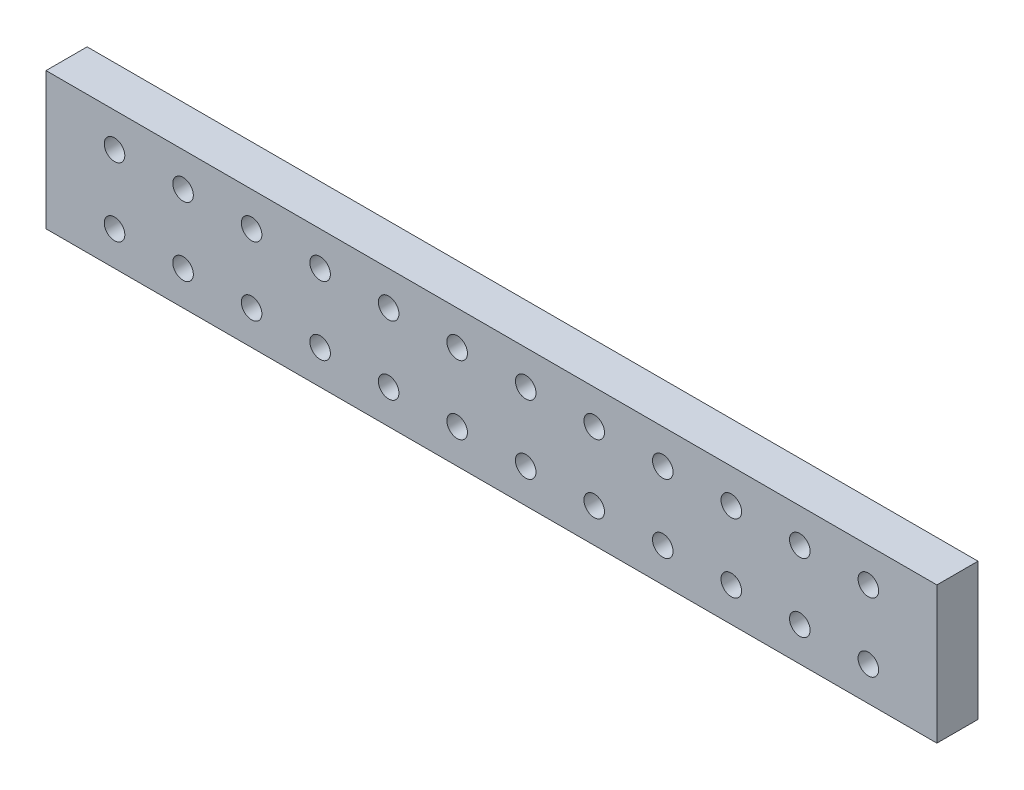
ISO-10303-21;
HEADER;
FILE_DESCRIPTION(('STEP AP214'),'2;1');
FILE_NAME('part.step','',(''),(''),'','','');
FILE_SCHEMA(('AUTOMOTIVE_DESIGN { 1 0 10303 214 1 1 1 1 }'));
ENDSEC;
DATA;
#1=APPLICATION_CONTEXT('core data for automotive mechanical design processes');
#2=APPLICATION_PROTOCOL_DEFINITION('international standard','automotive_design',2000,#1);
#3=PRODUCT_CONTEXT('',#1,'mechanical');
#4=PRODUCT('Part','Part','',(#3));
#5=PRODUCT_RELATED_PRODUCT_CATEGORY('part','',(#4));
#6=PRODUCT_DEFINITION_FORMATION('','',#4);
#7=PRODUCT_DEFINITION_CONTEXT('part definition',#1,'design');
#8=PRODUCT_DEFINITION('design','',#6,#7);
#9=PRODUCT_DEFINITION_SHAPE('','',#8);
#10=(LENGTH_UNIT() NAMED_UNIT(*) SI_UNIT(.MILLI.,.METRE.));
#11=(NAMED_UNIT(*) PLANE_ANGLE_UNIT() SI_UNIT($,.RADIAN.));
#12=(NAMED_UNIT(*) SI_UNIT($,.STERADIAN.) SOLID_ANGLE_UNIT());
#13=UNCERTAINTY_MEASURE_WITH_UNIT(LENGTH_MEASURE(1.E-05),#10,'distance_accuracy_value','');
#14=(GEOMETRIC_REPRESENTATION_CONTEXT(3) GLOBAL_UNCERTAINTY_ASSIGNED_CONTEXT((#13)) GLOBAL_UNIT_ASSIGNED_CONTEXT((#10,
#11,#12)) REPRESENTATION_CONTEXT('',''));
#15=CARTESIAN_POINT('',(0.,0.,0.));
#16=DIRECTION('',(0.,0.,1.));
#17=DIRECTION('',(1.,0.,0.));
#18=AXIS2_PLACEMENT_3D('',#15,#16,#17);
#19=CARTESIAN_POINT('',(0.,0.,6.));
#20=DIRECTION('',(0.,0.,1.));
#21=DIRECTION('',(1.,0.,0.));
#22=AXIS2_PLACEMENT_3D('',#19,#20,#21);
#23=PLANE('',#22);
#24=CARTESIAN_POINT('',(-0.733944954128396,-3.16513761467888,6.));
#25=DIRECTION('',(0.,0.,1.));
#26=DIRECTION('',(1.,0.,0.));
#27=AXIS2_PLACEMENT_3D('',#24,#25,#26);
#28=CIRCLE('',#27,1.5);
#29=CARTESIAN_POINT('',(0.766055045871602,-3.16513761467888,6.));
#30=VERTEX_POINT('',#29);
#31=EDGE_CURVE('E241',#30,#30,#28,.T.);
#32=ORIENTED_EDGE('',*,*,#31,.F.);
#33=EDGE_LOOP('',(#32));
#34=FACE_BOUND('',#33,.T.);
#35=CARTESIAN_POINT('',(-10.7339449541284,6.83486238532111,6.));
#36=DIRECTION('',(0.,0.,1.));
#37=DIRECTION('',(-1.,0.,0.));
#38=AXIS2_PLACEMENT_3D('',#35,#36,#37);
#39=CIRCLE('',#38,1.5);
#40=CARTESIAN_POINT('',(-12.2339449541284,6.83486238532111,6.));
#41=VERTEX_POINT('',#40);
#42=EDGE_CURVE('E229',#41,#41,#39,.T.);
#43=ORIENTED_EDGE('',*,*,#42,.F.);
#44=EDGE_LOOP('',(#43));
#45=FACE_BOUND('',#44,.T.);
#46=CARTESIAN_POINT('',(-20.7339449541284,-3.16513761467888,6.));
#47=DIRECTION('',(0.,0.,1.));
#48=DIRECTION('',(1.,0.,0.));
#49=AXIS2_PLACEMENT_3D('',#46,#47,#48);
#50=CIRCLE('',#49,1.5);
#51=CARTESIAN_POINT('',(-19.2339449541284,-3.16513761467888,6.));
#52=VERTEX_POINT('',#51);
#53=EDGE_CURVE('E217',#52,#52,#50,.T.);
#54=ORIENTED_EDGE('',*,*,#53,.F.);
#55=EDGE_LOOP('',(#54));
#56=FACE_BOUND('',#55,.T.);
#57=CARTESIAN_POINT('',(-30.7339449541284,6.83486238532111,6.));
#58=DIRECTION('',(0.,0.,1.));
#59=DIRECTION('',(-1.,0.,0.));
#60=AXIS2_PLACEMENT_3D('',#57,#58,#59);
#61=CIRCLE('',#60,1.5);
#62=CARTESIAN_POINT('',(-32.2339449541284,6.83486238532111,6.));
#63=VERTEX_POINT('',#62);
#64=EDGE_CURVE('E205',#63,#63,#61,.T.);
#65=ORIENTED_EDGE('',*,*,#64,.F.);
#66=EDGE_LOOP('',(#65));
#67=FACE_BOUND('',#66,.T.);
#68=CARTESIAN_POINT('',(-40.7339449541284,-3.16513761467889,6.));
#69=DIRECTION('',(0.,0.,1.));
#70=DIRECTION('',(1.,0.,0.));
#71=AXIS2_PLACEMENT_3D('',#68,#69,#70);
#72=CIRCLE('',#71,1.5);
#73=CARTESIAN_POINT('',(-39.2339449541284,-3.16513761467889,6.));
#74=VERTEX_POINT('',#73);
#75=EDGE_CURVE('E193',#74,#74,#72,.T.);
#76=ORIENTED_EDGE('',*,*,#75,.F.);
#77=EDGE_LOOP('',(#76));
#78=FACE_BOUND('',#77,.T.);
#79=CARTESIAN_POINT('',(19.2660550458716,-3.16513761467888,6.));
#80=DIRECTION('',(0.,0.,1.));
#81=DIRECTION('',(-1.,0.,0.));
#82=AXIS2_PLACEMENT_3D('',#79,#80,#81);
#83=CIRCLE('',#82,1.5);
#84=CARTESIAN_POINT('',(17.7660550458716,-3.16513761467888,6.));
#85=VERTEX_POINT('',#84);
#86=EDGE_CURVE('E181',#85,#85,#83,.T.);
#87=ORIENTED_EDGE('',*,*,#86,.F.);
#88=EDGE_LOOP('',(#87));
#89=FACE_BOUND('',#88,.T.);
#90=CARTESIAN_POINT('',(39.2660550458716,-3.16513761467889,6.));
#91=DIRECTION('',(0.,0.,1.));
#92=DIRECTION('',(-1.,0.,0.));
#93=AXIS2_PLACEMENT_3D('',#90,#91,#92);
#94=CIRCLE('',#93,1.5);
#95=CARTESIAN_POINT('',(37.7660550458716,-3.16513761467889,6.));
#96=VERTEX_POINT('',#95);
#97=EDGE_CURVE('E169',#96,#96,#94,.T.);
#98=ORIENTED_EDGE('',*,*,#97,.F.);
#99=EDGE_LOOP('',(#98));
#100=FACE_BOUND('',#99,.T.);
#101=CARTESIAN_POINT('',(9.26605504587157,6.8348623853211,6.));
#102=DIRECTION('',(0.,0.,1.));
#103=DIRECTION('',(1.,0.,0.));
#104=AXIS2_PLACEMENT_3D('',#101,#102,#103);
#105=CIRCLE('',#104,1.5);
#106=CARTESIAN_POINT('',(10.7660550458716,6.8348623853211,6.));
#107=VERTEX_POINT('',#106);
#108=EDGE_CURVE('E157',#107,#107,#105,.T.);
#109=ORIENTED_EDGE('',*,*,#108,.F.);
#110=EDGE_LOOP('',(#109));
#111=FACE_BOUND('',#110,.T.);
#112=CARTESIAN_POINT('',(29.2660550458716,6.83486238532111,6.));
#113=DIRECTION('',(0.,0.,1.));
#114=DIRECTION('',(1.,0.,0.));
#115=AXIS2_PLACEMENT_3D('',#112,#113,#114);
#116=CIRCLE('',#115,1.5);
#117=CARTESIAN_POINT('',(30.7660550458716,6.83486238532111,6.));
#118=VERTEX_POINT('',#117);
#119=EDGE_CURVE('E145',#118,#118,#116,.T.);
#120=ORIENTED_EDGE('',*,*,#119,.F.);
#121=EDGE_LOOP('',(#120));
#122=FACE_BOUND('',#121,.T.);
#123=CARTESIAN_POINT('',(49.2660550458716,6.83486238532111,6.));
#124=DIRECTION('',(0.,0.,1.));
#125=DIRECTION('',(1.,0.,0.));
#126=AXIS2_PLACEMENT_3D('',#123,#124,#125);
#127=CIRCLE('',#126,1.5);
#128=CARTESIAN_POINT('',(50.7660550458716,6.83486238532111,6.));
#129=VERTEX_POINT('',#128);
#130=EDGE_CURVE('E133',#129,#129,#127,.T.);
#131=ORIENTED_EDGE('',*,*,#130,.F.);
#132=EDGE_LOOP('',(#131));
#133=FACE_BOUND('',#132,.T.);
#134=CARTESIAN_POINT('',(-50.7339449541284,-3.16513761467889,6.));
#135=DIRECTION('',(0.,0.,1.));
#136=DIRECTION('',(-1.,0.,0.));
#137=AXIS2_PLACEMENT_3D('',#134,#135,#136);
#138=CIRCLE('',#137,1.5);
#139=CARTESIAN_POINT('',(-52.2339449541284,-3.16513761467889,6.));
#140=VERTEX_POINT('',#139);
#141=EDGE_CURVE('E121',#140,#140,#138,.T.);
#142=ORIENTED_EDGE('',*,*,#141,.F.);
#143=EDGE_LOOP('',(#142));
#144=FACE_BOUND('',#143,.T.);
#145=CARTESIAN_POINT('',(59.2660550458716,-3.16513761467889,6.));
#146=DIRECTION('',(0.,0.,1.));
#147=DIRECTION('',(1.,0.,0.));
#148=AXIS2_PLACEMENT_3D('',#145,#146,#147);
#149=CIRCLE('',#148,1.5);
#150=CARTESIAN_POINT('',(60.7660550458716,-3.16513761467889,6.));
#151=VERTEX_POINT('',#150);
#152=EDGE_CURVE('E100',#151,#151,#149,.T.);
#153=ORIENTED_EDGE('',*,*,#152,.F.);
#154=EDGE_LOOP('',(#153));
#155=FACE_BOUND('',#154,.T.);
#156=DIRECTION('',(0.,-1.,0.));
#157=VECTOR('',#156,1.);
#158=CARTESIAN_POINT('',(-60.7339449541284,11.8348623853211,6.));
#159=LINE('',#158,#157);
#160=CARTESIAN_POINT('',(-60.7339449541284,11.8348623853211,6.));
#161=VERTEX_POINT('',#160);
#162=CARTESIAN_POINT('',(-60.7339449541284,-8.16513761467889,6.));
#163=VERTEX_POINT('',#162);
#164=EDGE_CURVE('E85',#161,#163,#159,.T.);
#165=ORIENTED_EDGE('',*,*,#164,.T.);
#166=DIRECTION('',(1.,0.,0.));
#167=VECTOR('',#166,1.);
#168=CARTESIAN_POINT('',(-60.7339449541284,-8.16513761467889,6.));
#169=LINE('',#168,#167);
#170=CARTESIAN_POINT('',(69.2660550458716,-8.16513761467889,6.));
#171=VERTEX_POINT('',#170);
#172=EDGE_CURVE('E80',#163,#171,#169,.T.);
#173=ORIENTED_EDGE('',*,*,#172,.T.);
#174=DIRECTION('',(0.,1.,0.));
#175=VECTOR('',#174,1.);
#176=CARTESIAN_POINT('',(69.2660550458716,11.8348623853211,6.));
#177=LINE('',#176,#175);
#178=CARTESIAN_POINT('',(69.2660550458716,11.8348623853211,6.));
#179=VERTEX_POINT('',#178);
#180=EDGE_CURVE('E83',#171,#179,#177,.T.);
#181=ORIENTED_EDGE('',*,*,#180,.T.);
#182=DIRECTION('',(-1.,0.,0.));
#183=VECTOR('',#182,1.);
#184=CARTESIAN_POINT('',(-60.7339449541284,11.8348623853211,6.));
#185=LINE('',#184,#183);
#186=EDGE_CURVE('E50',#179,#161,#185,.T.);
#187=ORIENTED_EDGE('',*,*,#186,.T.);
#188=EDGE_LOOP('',(#165,#173,#181,#187));
#189=FACE_BOUND('',#188,.T.);
#190=CARTESIAN_POINT('',(59.2660550458716,6.83486238532111,6.));
#191=DIRECTION('',(0.,0.,1.));
#192=DIRECTION('',(-1.,0.,0.));
#193=AXIS2_PLACEMENT_3D('',#190,#191,#192);
#194=CIRCLE('',#193,1.5);
#195=CARTESIAN_POINT('',(57.7660550458716,6.83486238532111,6.));
#196=VERTEX_POINT('',#195);
#197=EDGE_CURVE('E115',#196,#196,#194,.T.);
#198=ORIENTED_EDGE('',*,*,#197,.F.);
#199=EDGE_LOOP('',(#198));
#200=FACE_BOUND('',#199,.T.);
#201=CARTESIAN_POINT('',(-50.7339449541284,6.83486238532111,6.));
#202=DIRECTION('',(0.,0.,1.));
#203=DIRECTION('',(1.,0.,0.));
#204=AXIS2_PLACEMENT_3D('',#201,#202,#203);
#205=CIRCLE('',#204,1.5);
#206=CARTESIAN_POINT('',(-49.2339449541284,6.83486238532111,6.));
#207=VERTEX_POINT('',#206);
#208=EDGE_CURVE('E127',#207,#207,#205,.T.);
#209=ORIENTED_EDGE('',*,*,#208,.F.);
#210=EDGE_LOOP('',(#209));
#211=FACE_BOUND('',#210,.T.);
#212=CARTESIAN_POINT('',(39.2660550458716,6.83486238532111,6.));
#213=DIRECTION('',(0.,0.,1.));
#214=DIRECTION('',(1.,0.,0.));
#215=AXIS2_PLACEMENT_3D('',#212,#213,#214);
#216=CIRCLE('',#215,1.5);
#217=CARTESIAN_POINT('',(40.7660550458716,6.83486238532111,6.));
#218=VERTEX_POINT('',#217);
#219=EDGE_CURVE('E139',#218,#218,#216,.T.);
#220=ORIENTED_EDGE('',*,*,#219,.F.);
#221=EDGE_LOOP('',(#220));
#222=FACE_BOUND('',#221,.T.);
#223=CARTESIAN_POINT('',(19.2660550458716,6.83486238532111,6.));
#224=DIRECTION('',(0.,0.,1.));
#225=DIRECTION('',(1.,0.,0.));
#226=AXIS2_PLACEMENT_3D('',#223,#224,#225);
#227=CIRCLE('',#226,1.5);
#228=CARTESIAN_POINT('',(20.7660550458716,6.83486238532111,6.));
#229=VERTEX_POINT('',#228);
#230=EDGE_CURVE('E151',#229,#229,#227,.T.);
#231=ORIENTED_EDGE('',*,*,#230,.F.);
#232=EDGE_LOOP('',(#231));
#233=FACE_BOUND('',#232,.T.);
#234=CARTESIAN_POINT('',(49.2660550458716,-3.16513761467889,6.));
#235=DIRECTION('',(0.,0.,1.));
#236=DIRECTION('',(-1.,0.,0.));
#237=AXIS2_PLACEMENT_3D('',#234,#235,#236);
#238=CIRCLE('',#237,1.5);
#239=CARTESIAN_POINT('',(47.7660550458716,-3.16513761467889,6.));
#240=VERTEX_POINT('',#239);
#241=EDGE_CURVE('E163',#240,#240,#238,.T.);
#242=ORIENTED_EDGE('',*,*,#241,.F.);
#243=EDGE_LOOP('',(#242));
#244=FACE_BOUND('',#243,.T.);
#245=CARTESIAN_POINT('',(29.2660550458716,-3.16513761467888,6.));
#246=DIRECTION('',(0.,0.,1.));
#247=DIRECTION('',(-1.,0.,0.));
#248=AXIS2_PLACEMENT_3D('',#245,#246,#247);
#249=CIRCLE('',#248,1.5);
#250=CARTESIAN_POINT('',(27.7660550458716,-3.16513761467888,6.));
#251=VERTEX_POINT('',#250);
#252=EDGE_CURVE('E175',#251,#251,#249,.T.);
#253=ORIENTED_EDGE('',*,*,#252,.F.);
#254=EDGE_LOOP('',(#253));
#255=FACE_BOUND('',#254,.T.);
#256=CARTESIAN_POINT('',(9.26605504587157,-3.16513761467888,6.));
#257=DIRECTION('',(0.,0.,1.));
#258=DIRECTION('',(-1.,0.,0.));
#259=AXIS2_PLACEMENT_3D('',#256,#257,#258);
#260=CIRCLE('',#259,1.5);
#261=CARTESIAN_POINT('',(7.76605504587158,-3.16513761467888,6.));
#262=VERTEX_POINT('',#261);
#263=EDGE_CURVE('E187',#262,#262,#260,.T.);
#264=ORIENTED_EDGE('',*,*,#263,.F.);
#265=EDGE_LOOP('',(#264));
#266=FACE_BOUND('',#265,.T.);
#267=CARTESIAN_POINT('',(-40.7339449541284,6.83486238532111,6.));
#268=DIRECTION('',(0.,0.,1.));
#269=DIRECTION('',(-1.,0.,0.));
#270=AXIS2_PLACEMENT_3D('',#267,#268,#269);
#271=CIRCLE('',#270,1.5);
#272=CARTESIAN_POINT('',(-42.2339449541284,6.83486238532111,6.));
#273=VERTEX_POINT('',#272);
#274=EDGE_CURVE('E199',#273,#273,#271,.T.);
#275=ORIENTED_EDGE('',*,*,#274,.F.);
#276=EDGE_LOOP('',(#275));
#277=FACE_BOUND('',#276,.T.);
#278=CARTESIAN_POINT('',(-30.7339449541284,-3.16513761467889,6.));
#279=DIRECTION('',(0.,0.,1.));
#280=DIRECTION('',(1.,0.,0.));
#281=AXIS2_PLACEMENT_3D('',#278,#279,#280);
#282=CIRCLE('',#281,1.5);
#283=CARTESIAN_POINT('',(-29.2339449541284,-3.16513761467889,6.));
#284=VERTEX_POINT('',#283);
#285=EDGE_CURVE('E211',#284,#284,#282,.T.);
#286=ORIENTED_EDGE('',*,*,#285,.F.);
#287=EDGE_LOOP('',(#286));
#288=FACE_BOUND('',#287,.T.);
#289=CARTESIAN_POINT('',(-20.7339449541284,6.83486238532111,6.));
#290=DIRECTION('',(0.,0.,1.));
#291=DIRECTION('',(-1.,0.,0.));
#292=AXIS2_PLACEMENT_3D('',#289,#290,#291);
#293=CIRCLE('',#292,1.5);
#294=CARTESIAN_POINT('',(-22.2339449541284,6.83486238532111,6.));
#295=VERTEX_POINT('',#294);
#296=EDGE_CURVE('E223',#295,#295,#293,.T.);
#297=ORIENTED_EDGE('',*,*,#296,.F.);
#298=EDGE_LOOP('',(#297));
#299=FACE_BOUND('',#298,.T.);
#300=CARTESIAN_POINT('',(-10.7339449541284,-3.16513761467888,6.));
#301=DIRECTION('',(0.,0.,1.));
#302=DIRECTION('',(1.,0.,0.));
#303=AXIS2_PLACEMENT_3D('',#300,#301,#302);
#304=CIRCLE('',#303,1.5);
#305=CARTESIAN_POINT('',(-9.2339449541284,-3.16513761467888,6.));
#306=VERTEX_POINT('',#305);
#307=EDGE_CURVE('E235',#306,#306,#304,.T.);
#308=ORIENTED_EDGE('',*,*,#307,.F.);
#309=EDGE_LOOP('',(#308));
#310=FACE_BOUND('',#309,.T.);
#311=CARTESIAN_POINT('',(-0.733944954128396,6.8348623853211,6.));
#312=DIRECTION('',(0.,0.,1.));
#313=DIRECTION('',(-1.,0.,0.));
#314=AXIS2_PLACEMENT_3D('',#311,#312,#313);
#315=CIRCLE('',#314,1.5);
#316=CARTESIAN_POINT('',(-2.2339449541284,6.8348623853211,6.));
#317=VERTEX_POINT('',#316);
#318=EDGE_CURVE('E247',#317,#317,#315,.T.);
#319=ORIENTED_EDGE('',*,*,#318,.F.);
#320=EDGE_LOOP('',(#319));
#321=FACE_BOUND('',#320,.T.);
#322=ADVANCED_FACE('F33',(#34,#45,#56,#67,#78,#89,#100,#111,#122,#133,#144,#155,#189,#200,#211,
#222,#233,#244,#255,#266,#277,#288,#299,#310,#321),#23,.T.);
#323=CARTESIAN_POINT('',(0.,0.,0.));
#324=DIRECTION('',(0.,0.,1.));
#325=DIRECTION('',(1.,0.,0.));
#326=AXIS2_PLACEMENT_3D('',#323,#324,#325);
#327=PLANE('',#326);
#328=DIRECTION('',(0.,-1.,0.));
#329=VECTOR('',#328,1.);
#330=CARTESIAN_POINT('',(-60.7339449541284,11.8348623853211,0.));
#331=LINE('',#330,#329);
#332=CARTESIAN_POINT('',(-60.7339449541284,11.8348623853211,0.));
#333=VERTEX_POINT('',#332);
#334=CARTESIAN_POINT('',(-60.7339449541284,-8.16513761467889,0.));
#335=VERTEX_POINT('',#334);
#336=EDGE_CURVE('E97',#333,#335,#331,.T.);
#337=ORIENTED_EDGE('',*,*,#336,.F.);
#338=DIRECTION('',(-1.,0.,0.));
#339=VECTOR('',#338,1.);
#340=CARTESIAN_POINT('',(-60.7339449541284,11.8348623853211,0.));
#341=LINE('',#340,#339);
#342=CARTESIAN_POINT('',(69.2660550458716,11.8348623853211,0.));
#343=VERTEX_POINT('',#342);
#344=EDGE_CURVE('E73',#343,#333,#341,.T.);
#345=ORIENTED_EDGE('',*,*,#344,.F.);
#346=DIRECTION('',(0.,1.,0.));
#347=VECTOR('',#346,1.);
#348=CARTESIAN_POINT('',(69.2660550458716,11.8348623853211,0.));
#349=LINE('',#348,#347);
#350=CARTESIAN_POINT('',(69.2660550458716,-8.16513761467889,0.));
#351=VERTEX_POINT('',#350);
#352=EDGE_CURVE('E67',#351,#343,#349,.T.);
#353=ORIENTED_EDGE('',*,*,#352,.F.);
#354=DIRECTION('',(1.,0.,0.));
#355=VECTOR('',#354,1.);
#356=CARTESIAN_POINT('',(-60.7339449541284,-8.16513761467889,0.));
#357=LINE('',#356,#355);
#358=EDGE_CURVE('E89',#335,#351,#357,.T.);
#359=ORIENTED_EDGE('',*,*,#358,.F.);
#360=EDGE_LOOP('',(#337,#345,#353,#359));
#361=FACE_BOUND('',#360,.T.);
#362=CARTESIAN_POINT('',(59.2660550458716,-3.16513761467889,0.));
#363=DIRECTION('',(0.,0.,1.));
#364=DIRECTION('',(1.,0.,0.));
#365=AXIS2_PLACEMENT_3D('',#362,#363,#364);
#366=CIRCLE('',#365,1.5);
#367=CARTESIAN_POINT('',(60.7660550458716,-3.16513761467889,0.));
#368=VERTEX_POINT('',#367);
#369=EDGE_CURVE('E112',#368,#368,#366,.T.);
#370=ORIENTED_EDGE('',*,*,#369,.T.);
#371=EDGE_LOOP('',(#370));
#372=FACE_BOUND('',#371,.T.);
#373=CARTESIAN_POINT('',(59.2660550458716,6.83486238532111,0.));
#374=DIRECTION('',(0.,0.,1.));
#375=DIRECTION('',(-1.,0.,0.));
#376=AXIS2_PLACEMENT_3D('',#373,#374,#375);
#377=CIRCLE('',#376,1.5);
#378=CARTESIAN_POINT('',(57.7660550458716,6.83486238532111,0.));
#379=VERTEX_POINT('',#378);
#380=EDGE_CURVE('E118',#379,#379,#377,.T.);
#381=ORIENTED_EDGE('',*,*,#380,.T.);
#382=EDGE_LOOP('',(#381));
#383=FACE_BOUND('',#382,.T.);
#384=CARTESIAN_POINT('',(-50.7339449541284,-3.16513761467889,0.));
#385=DIRECTION('',(0.,0.,1.));
#386=DIRECTION('',(-1.,0.,0.));
#387=AXIS2_PLACEMENT_3D('',#384,#385,#386);
#388=CIRCLE('',#387,1.5);
#389=CARTESIAN_POINT('',(-52.2339449541284,-3.16513761467889,0.));
#390=VERTEX_POINT('',#389);
#391=EDGE_CURVE('E124',#390,#390,#388,.T.);
#392=ORIENTED_EDGE('',*,*,#391,.T.);
#393=EDGE_LOOP('',(#392));
#394=FACE_BOUND('',#393,.T.);
#395=CARTESIAN_POINT('',(-50.7339449541284,6.83486238532111,0.));
#396=DIRECTION('',(0.,0.,1.));
#397=DIRECTION('',(1.,0.,0.));
#398=AXIS2_PLACEMENT_3D('',#395,#396,#397);
#399=CIRCLE('',#398,1.5);
#400=CARTESIAN_POINT('',(-49.2339449541284,6.83486238532111,0.));
#401=VERTEX_POINT('',#400);
#402=EDGE_CURVE('E130',#401,#401,#399,.T.);
#403=ORIENTED_EDGE('',*,*,#402,.T.);
#404=EDGE_LOOP('',(#403));
#405=FACE_BOUND('',#404,.T.);
#406=CARTESIAN_POINT('',(49.2660550458716,6.83486238532111,0.));
#407=DIRECTION('',(0.,0.,1.));
#408=DIRECTION('',(1.,0.,0.));
#409=AXIS2_PLACEMENT_3D('',#406,#407,#408);
#410=CIRCLE('',#409,1.5);
#411=CARTESIAN_POINT('',(50.7660550458716,6.83486238532111,0.));
#412=VERTEX_POINT('',#411);
#413=EDGE_CURVE('E136',#412,#412,#410,.T.);
#414=ORIENTED_EDGE('',*,*,#413,.T.);
#415=EDGE_LOOP('',(#414));
#416=FACE_BOUND('',#415,.T.);
#417=CARTESIAN_POINT('',(39.2660550458716,6.83486238532111,0.));
#418=DIRECTION('',(0.,0.,1.));
#419=DIRECTION('',(1.,0.,0.));
#420=AXIS2_PLACEMENT_3D('',#417,#418,#419);
#421=CIRCLE('',#420,1.5);
#422=CARTESIAN_POINT('',(40.7660550458716,6.83486238532111,0.));
#423=VERTEX_POINT('',#422);
#424=EDGE_CURVE('E142',#423,#423,#421,.T.);
#425=ORIENTED_EDGE('',*,*,#424,.T.);
#426=EDGE_LOOP('',(#425));
#427=FACE_BOUND('',#426,.T.);
#428=CARTESIAN_POINT('',(29.2660550458716,6.83486238532111,0.));
#429=DIRECTION('',(0.,0.,1.));
#430=DIRECTION('',(1.,0.,0.));
#431=AXIS2_PLACEMENT_3D('',#428,#429,#430);
#432=CIRCLE('',#431,1.5);
#433=CARTESIAN_POINT('',(30.7660550458716,6.83486238532111,0.));
#434=VERTEX_POINT('',#433);
#435=EDGE_CURVE('E148',#434,#434,#432,.T.);
#436=ORIENTED_EDGE('',*,*,#435,.T.);
#437=EDGE_LOOP('',(#436));
#438=FACE_BOUND('',#437,.T.);
#439=CARTESIAN_POINT('',(19.2660550458716,6.83486238532111,0.));
#440=DIRECTION('',(0.,0.,1.));
#441=DIRECTION('',(1.,0.,0.));
#442=AXIS2_PLACEMENT_3D('',#439,#440,#441);
#443=CIRCLE('',#442,1.5);
#444=CARTESIAN_POINT('',(20.7660550458716,6.83486238532111,0.));
#445=VERTEX_POINT('',#444);
#446=EDGE_CURVE('E154',#445,#445,#443,.T.);
#447=ORIENTED_EDGE('',*,*,#446,.T.);
#448=EDGE_LOOP('',(#447));
#449=FACE_BOUND('',#448,.T.);
#450=CARTESIAN_POINT('',(9.26605504587157,6.8348623853211,0.));
#451=DIRECTION('',(0.,0.,1.));
#452=DIRECTION('',(1.,0.,0.));
#453=AXIS2_PLACEMENT_3D('',#450,#451,#452);
#454=CIRCLE('',#453,1.5);
#455=CARTESIAN_POINT('',(10.7660550458716,6.8348623853211,0.));
#456=VERTEX_POINT('',#455);
#457=EDGE_CURVE('E160',#456,#456,#454,.T.);
#458=ORIENTED_EDGE('',*,*,#457,.T.);
#459=EDGE_LOOP('',(#458));
#460=FACE_BOUND('',#459,.T.);
#461=CARTESIAN_POINT('',(49.2660550458716,-3.16513761467889,0.));
#462=DIRECTION('',(0.,0.,1.));
#463=DIRECTION('',(-1.,0.,0.));
#464=AXIS2_PLACEMENT_3D('',#461,#462,#463);
#465=CIRCLE('',#464,1.5);
#466=CARTESIAN_POINT('',(47.7660550458716,-3.16513761467889,0.));
#467=VERTEX_POINT('',#466);
#468=EDGE_CURVE('E166',#467,#467,#465,.T.);
#469=ORIENTED_EDGE('',*,*,#468,.T.);
#470=EDGE_LOOP('',(#469));
#471=FACE_BOUND('',#470,.T.);
#472=CARTESIAN_POINT('',(39.2660550458716,-3.16513761467889,0.));
#473=DIRECTION('',(0.,0.,1.));
#474=DIRECTION('',(-1.,0.,0.));
#475=AXIS2_PLACEMENT_3D('',#472,#473,#474);
#476=CIRCLE('',#475,1.5);
#477=CARTESIAN_POINT('',(37.7660550458716,-3.16513761467889,0.));
#478=VERTEX_POINT('',#477);
#479=EDGE_CURVE('E172',#478,#478,#476,.T.);
#480=ORIENTED_EDGE('',*,*,#479,.T.);
#481=EDGE_LOOP('',(#480));
#482=FACE_BOUND('',#481,.T.);
#483=CARTESIAN_POINT('',(29.2660550458716,-3.16513761467888,0.));
#484=DIRECTION('',(0.,0.,1.));
#485=DIRECTION('',(-1.,0.,0.));
#486=AXIS2_PLACEMENT_3D('',#483,#484,#485);
#487=CIRCLE('',#486,1.5);
#488=CARTESIAN_POINT('',(27.7660550458716,-3.16513761467888,0.));
#489=VERTEX_POINT('',#488);
#490=EDGE_CURVE('E178',#489,#489,#487,.T.);
#491=ORIENTED_EDGE('',*,*,#490,.T.);
#492=EDGE_LOOP('',(#491));
#493=FACE_BOUND('',#492,.T.);
#494=CARTESIAN_POINT('',(19.2660550458716,-3.16513761467888,0.));
#495=DIRECTION('',(0.,0.,1.));
#496=DIRECTION('',(-1.,0.,0.));
#497=AXIS2_PLACEMENT_3D('',#494,#495,#496);
#498=CIRCLE('',#497,1.5);
#499=CARTESIAN_POINT('',(17.7660550458716,-3.16513761467888,0.));
#500=VERTEX_POINT('',#499);
#501=EDGE_CURVE('E184',#500,#500,#498,.T.);
#502=ORIENTED_EDGE('',*,*,#501,.T.);
#503=EDGE_LOOP('',(#502));
#504=FACE_BOUND('',#503,.T.);
#505=CARTESIAN_POINT('',(9.26605504587157,-3.16513761467888,0.));
#506=DIRECTION('',(0.,0.,1.));
#507=DIRECTION('',(-1.,0.,0.));
#508=AXIS2_PLACEMENT_3D('',#505,#506,#507);
#509=CIRCLE('',#508,1.5);
#510=CARTESIAN_POINT('',(7.76605504587158,-3.16513761467888,0.));
#511=VERTEX_POINT('',#510);
#512=EDGE_CURVE('E190',#511,#511,#509,.T.);
#513=ORIENTED_EDGE('',*,*,#512,.T.);
#514=EDGE_LOOP('',(#513));
#515=FACE_BOUND('',#514,.T.);
#516=CARTESIAN_POINT('',(-40.7339449541284,-3.16513761467889,0.));
#517=DIRECTION('',(0.,0.,1.));
#518=DIRECTION('',(1.,0.,0.));
#519=AXIS2_PLACEMENT_3D('',#516,#517,#518);
#520=CIRCLE('',#519,1.5);
#521=CARTESIAN_POINT('',(-39.2339449541284,-3.16513761467889,0.));
#522=VERTEX_POINT('',#521);
#523=EDGE_CURVE('E196',#522,#522,#520,.T.);
#524=ORIENTED_EDGE('',*,*,#523,.T.);
#525=EDGE_LOOP('',(#524));
#526=FACE_BOUND('',#525,.T.);
#527=CARTESIAN_POINT('',(-40.7339449541284,6.83486238532111,0.));
#528=DIRECTION('',(0.,0.,1.));
#529=DIRECTION('',(-1.,0.,0.));
#530=AXIS2_PLACEMENT_3D('',#527,#528,#529);
#531=CIRCLE('',#530,1.5);
#532=CARTESIAN_POINT('',(-42.2339449541284,6.83486238532111,0.));
#533=VERTEX_POINT('',#532);
#534=EDGE_CURVE('E202',#533,#533,#531,.T.);
#535=ORIENTED_EDGE('',*,*,#534,.T.);
#536=EDGE_LOOP('',(#535));
#537=FACE_BOUND('',#536,.T.);
#538=CARTESIAN_POINT('',(-30.7339449541284,6.83486238532111,0.));
#539=DIRECTION('',(0.,0.,1.));
#540=DIRECTION('',(-1.,0.,0.));
#541=AXIS2_PLACEMENT_3D('',#538,#539,#540);
#542=CIRCLE('',#541,1.5);
#543=CARTESIAN_POINT('',(-32.2339449541284,6.83486238532111,0.));
#544=VERTEX_POINT('',#543);
#545=EDGE_CURVE('E208',#544,#544,#542,.T.);
#546=ORIENTED_EDGE('',*,*,#545,.T.);
#547=EDGE_LOOP('',(#546));
#548=FACE_BOUND('',#547,.T.);
#549=CARTESIAN_POINT('',(-30.7339449541284,-3.16513761467889,0.));
#550=DIRECTION('',(0.,0.,1.));
#551=DIRECTION('',(1.,0.,0.));
#552=AXIS2_PLACEMENT_3D('',#549,#550,#551);
#553=CIRCLE('',#552,1.5);
#554=CARTESIAN_POINT('',(-29.2339449541284,-3.16513761467889,0.));
#555=VERTEX_POINT('',#554);
#556=EDGE_CURVE('E214',#555,#555,#553,.T.);
#557=ORIENTED_EDGE('',*,*,#556,.T.);
#558=EDGE_LOOP('',(#557));
#559=FACE_BOUND('',#558,.T.);
#560=CARTESIAN_POINT('',(-20.7339449541284,-3.16513761467888,0.));
#561=DIRECTION('',(0.,0.,1.));
#562=DIRECTION('',(1.,0.,0.));
#563=AXIS2_PLACEMENT_3D('',#560,#561,#562);
#564=CIRCLE('',#563,1.5);
#565=CARTESIAN_POINT('',(-19.2339449541284,-3.16513761467888,0.));
#566=VERTEX_POINT('',#565);
#567=EDGE_CURVE('E220',#566,#566,#564,.T.);
#568=ORIENTED_EDGE('',*,*,#567,.T.);
#569=EDGE_LOOP('',(#568));
#570=FACE_BOUND('',#569,.T.);
#571=CARTESIAN_POINT('',(-20.7339449541284,6.83486238532111,0.));
#572=DIRECTION('',(0.,0.,1.));
#573=DIRECTION('',(-1.,0.,0.));
#574=AXIS2_PLACEMENT_3D('',#571,#572,#573);
#575=CIRCLE('',#574,1.5);
#576=CARTESIAN_POINT('',(-22.2339449541284,6.83486238532111,0.));
#577=VERTEX_POINT('',#576);
#578=EDGE_CURVE('E226',#577,#577,#575,.T.);
#579=ORIENTED_EDGE('',*,*,#578,.T.);
#580=EDGE_LOOP('',(#579));
#581=FACE_BOUND('',#580,.T.);
#582=CARTESIAN_POINT('',(-10.7339449541284,6.83486238532111,0.));
#583=DIRECTION('',(0.,0.,1.));
#584=DIRECTION('',(-1.,0.,0.));
#585=AXIS2_PLACEMENT_3D('',#582,#583,#584);
#586=CIRCLE('',#585,1.5);
#587=CARTESIAN_POINT('',(-12.2339449541284,6.83486238532111,0.));
#588=VERTEX_POINT('',#587);
#589=EDGE_CURVE('E232',#588,#588,#586,.T.);
#590=ORIENTED_EDGE('',*,*,#589,.T.);
#591=EDGE_LOOP('',(#590));
#592=FACE_BOUND('',#591,.T.);
#593=CARTESIAN_POINT('',(-10.7339449541284,-3.16513761467888,0.));
#594=DIRECTION('',(0.,0.,1.));
#595=DIRECTION('',(1.,0.,0.));
#596=AXIS2_PLACEMENT_3D('',#593,#594,#595);
#597=CIRCLE('',#596,1.5);
#598=CARTESIAN_POINT('',(-9.2339449541284,-3.16513761467888,0.));
#599=VERTEX_POINT('',#598);
#600=EDGE_CURVE('E238',#599,#599,#597,.T.);
#601=ORIENTED_EDGE('',*,*,#600,.T.);
#602=EDGE_LOOP('',(#601));
#603=FACE_BOUND('',#602,.T.);
#604=CARTESIAN_POINT('',(-0.733944954128396,-3.16513761467888,0.));
#605=DIRECTION('',(0.,0.,1.));
#606=DIRECTION('',(1.,0.,0.));
#607=AXIS2_PLACEMENT_3D('',#604,#605,#606);
#608=CIRCLE('',#607,1.5);
#609=CARTESIAN_POINT('',(0.766055045871602,-3.16513761467888,0.));
#610=VERTEX_POINT('',#609);
#611=EDGE_CURVE('E244',#610,#610,#608,.T.);
#612=ORIENTED_EDGE('',*,*,#611,.T.);
#613=EDGE_LOOP('',(#612));
#614=FACE_BOUND('',#613,.T.);
#615=CARTESIAN_POINT('',(-0.733944954128396,6.8348623853211,0.));
#616=DIRECTION('',(0.,0.,1.));
#617=DIRECTION('',(-1.,0.,0.));
#618=AXIS2_PLACEMENT_3D('',#615,#616,#617);
#619=CIRCLE('',#618,1.5);
#620=CARTESIAN_POINT('',(-2.2339449541284,6.8348623853211,0.));
#621=VERTEX_POINT('',#620);
#622=EDGE_CURVE('E250',#621,#621,#619,.T.);
#623=ORIENTED_EDGE('',*,*,#622,.T.);
#624=EDGE_LOOP('',(#623));
#625=FACE_BOUND('',#624,.T.);
#626=ADVANCED_FACE('F108',(#361,#372,#383,#394,#405,#416,#427,#438,#449,#460,#471,#482,#493,
#504,#515,#526,#537,#548,#559,#570,#581,#592,#603,#614,#625),#327,.F.);
#627=CARTESIAN_POINT('',(-60.7339449541284,11.8348623853211,6.));
#628=DIRECTION('',(1.,0.,0.));
#629=DIRECTION('',(0.,0.,-1.));
#630=AXIS2_PLACEMENT_3D('',#627,#628,#629);
#631=PLANE('',#630);
#632=ORIENTED_EDGE('',*,*,#336,.T.);
#633=DIRECTION('',(0.,0.,-1.));
#634=VECTOR('',#633,1.);
#635=CARTESIAN_POINT('',(-60.7339449541284,-8.16513761467889,6.));
#636=LINE('',#635,#634);
#637=EDGE_CURVE('E11',#163,#335,#636,.T.);
#638=ORIENTED_EDGE('',*,*,#637,.F.);
#639=ORIENTED_EDGE('',*,*,#164,.F.);
#640=DIRECTION('',(0.,0.,-1.));
#641=VECTOR('',#640,1.);
#642=CARTESIAN_POINT('',(-60.7339449541284,11.8348623853211,6.));
#643=LINE('',#642,#641);
#644=EDGE_CURVE('E93',#161,#333,#643,.T.);
#645=ORIENTED_EDGE('',*,*,#644,.T.);
#646=EDGE_LOOP('',(#632,#638,#639,#645));
#647=FACE_BOUND('',#646,.T.);
#648=ADVANCED_FACE('F35',(#647),#631,.F.);
#649=CARTESIAN_POINT('',(-60.7339449541284,-8.16513761467889,6.));
#650=DIRECTION('',(0.,1.,0.));
#651=DIRECTION('',(-1.,0.,0.));
#652=AXIS2_PLACEMENT_3D('',#649,#650,#651);
#653=PLANE('',#652);
#654=ORIENTED_EDGE('',*,*,#358,.T.);
#655=DIRECTION('',(0.,0.,-1.));
#656=VECTOR('',#655,1.);
#657=CARTESIAN_POINT('',(69.2660550458716,-8.16513761467889,6.));
#658=LINE('',#657,#656);
#659=EDGE_CURVE('E42',#171,#351,#658,.T.);
#660=ORIENTED_EDGE('',*,*,#659,.F.);
#661=ORIENTED_EDGE('',*,*,#172,.F.);
#662=ORIENTED_EDGE('',*,*,#637,.T.);
#663=EDGE_LOOP('',(#654,#660,#661,#662));
#664=FACE_BOUND('',#663,.T.);
#665=ADVANCED_FACE('F88',(#664),#653,.F.);
#666=CARTESIAN_POINT('',(69.2660550458716,11.8348623853211,6.));
#667=DIRECTION('',(-1.,0.,0.));
#668=DIRECTION('',(0.,0.,1.));
#669=AXIS2_PLACEMENT_3D('',#666,#667,#668);
#670=PLANE('',#669);
#671=ORIENTED_EDGE('',*,*,#352,.T.);
#672=DIRECTION('',(0.,0.,-1.));
#673=VECTOR('',#672,1.);
#674=CARTESIAN_POINT('',(69.2660550458716,11.8348623853211,6.));
#675=LINE('',#674,#673);
#676=EDGE_CURVE('E90',#179,#343,#675,.T.);
#677=ORIENTED_EDGE('',*,*,#676,.F.);
#678=ORIENTED_EDGE('',*,*,#180,.F.);
#679=ORIENTED_EDGE('',*,*,#659,.T.);
#680=EDGE_LOOP('',(#671,#677,#678,#679));
#681=FACE_BOUND('',#680,.T.);
#682=ADVANCED_FACE('F91',(#681),#670,.F.);
#683=CARTESIAN_POINT('',(-60.7339449541284,11.8348623853211,6.));
#684=DIRECTION('',(0.,-1.,0.));
#685=DIRECTION('',(0.,0.,-1.));
#686=AXIS2_PLACEMENT_3D('',#683,#684,#685);
#687=PLANE('',#686);
#688=ORIENTED_EDGE('',*,*,#344,.T.);
#689=ORIENTED_EDGE('',*,*,#644,.F.);
#690=ORIENTED_EDGE('',*,*,#186,.F.);
#691=ORIENTED_EDGE('',*,*,#676,.T.);
#692=EDGE_LOOP('',(#688,#689,#690,#691));
#693=FACE_BOUND('',#692,.T.);
#694=ADVANCED_FACE('F105',(#693),#687,.F.);
#695=CARTESIAN_POINT('',(59.2660550458716,-3.16513761467889,6.));
#696=DIRECTION('',(0.,0.,-1.));
#697=DIRECTION('',(-1.,0.,0.));
#698=AXIS2_PLACEMENT_3D('',#695,#696,#697);
#699=CYLINDRICAL_SURFACE('',#698,1.5);
#700=ORIENTED_EDGE('',*,*,#152,.T.);
#701=EDGE_LOOP('',(#700));
#702=FACE_BOUND('',#701,.T.);
#703=ORIENTED_EDGE('',*,*,#369,.F.);
#704=EDGE_LOOP('',(#703));
#705=FACE_BOUND('',#704,.T.);
#706=ADVANCED_FACE('F269',(#702,#705),#699,.F.);
#707=CARTESIAN_POINT('',(59.2660550458716,6.83486238532111,6.));
#708=DIRECTION('',(0.,0.,-1.));
#709=DIRECTION('',(-1.,0.,0.));
#710=AXIS2_PLACEMENT_3D('',#707,#708,#709);
#711=CYLINDRICAL_SURFACE('',#710,1.5);
#712=ORIENTED_EDGE('',*,*,#197,.T.);
#713=EDGE_LOOP('',(#712));
#714=FACE_BOUND('',#713,.T.);
#715=ORIENTED_EDGE('',*,*,#380,.F.);
#716=EDGE_LOOP('',(#715));
#717=FACE_BOUND('',#716,.T.);
#718=ADVANCED_FACE('F315',(#714,#717),#711,.F.);
#719=CARTESIAN_POINT('',(-50.7339449541284,-3.16513761467889,6.));
#720=DIRECTION('',(0.,0.,-1.));
#721=DIRECTION('',(-1.,0.,0.));
#722=AXIS2_PLACEMENT_3D('',#719,#720,#721);
#723=CYLINDRICAL_SURFACE('',#722,1.5);
#724=ORIENTED_EDGE('',*,*,#141,.T.);
#725=EDGE_LOOP('',(#724));
#726=FACE_BOUND('',#725,.T.);
#727=ORIENTED_EDGE('',*,*,#391,.F.);
#728=EDGE_LOOP('',(#727));
#729=FACE_BOUND('',#728,.T.);
#730=ADVANCED_FACE('F323',(#726,#729),#723,.F.);
#731=CARTESIAN_POINT('',(-50.7339449541284,6.83486238532111,6.));
#732=DIRECTION('',(0.,0.,-1.));
#733=DIRECTION('',(-1.,0.,0.));
#734=AXIS2_PLACEMENT_3D('',#731,#732,#733);
#735=CYLINDRICAL_SURFACE('',#734,1.5);
#736=ORIENTED_EDGE('',*,*,#208,.T.);
#737=EDGE_LOOP('',(#736));
#738=FACE_BOUND('',#737,.T.);
#739=ORIENTED_EDGE('',*,*,#402,.F.);
#740=EDGE_LOOP('',(#739));
#741=FACE_BOUND('',#740,.T.);
#742=ADVANCED_FACE('F331',(#738,#741),#735,.F.);
#743=CARTESIAN_POINT('',(49.2660550458716,6.83486238532111,6.));
#744=DIRECTION('',(0.,0.,-1.));
#745=DIRECTION('',(-1.,0.,0.));
#746=AXIS2_PLACEMENT_3D('',#743,#744,#745);
#747=CYLINDRICAL_SURFACE('',#746,1.5);
#748=ORIENTED_EDGE('',*,*,#130,.T.);
#749=EDGE_LOOP('',(#748));
#750=FACE_BOUND('',#749,.T.);
#751=ORIENTED_EDGE('',*,*,#413,.F.);
#752=EDGE_LOOP('',(#751));
#753=FACE_BOUND('',#752,.T.);
#754=ADVANCED_FACE('F340',(#750,#753),#747,.F.);
#755=CARTESIAN_POINT('',(39.2660550458716,6.83486238532111,6.));
#756=DIRECTION('',(0.,0.,-1.));
#757=DIRECTION('',(-1.,0.,0.));
#758=AXIS2_PLACEMENT_3D('',#755,#756,#757);
#759=CYLINDRICAL_SURFACE('',#758,1.5);
#760=ORIENTED_EDGE('',*,*,#219,.T.);
#761=EDGE_LOOP('',(#760));
#762=FACE_BOUND('',#761,.T.);
#763=ORIENTED_EDGE('',*,*,#424,.F.);
#764=EDGE_LOOP('',(#763));
#765=FACE_BOUND('',#764,.T.);
#766=ADVANCED_FACE('F349',(#762,#765),#759,.F.);
#767=CARTESIAN_POINT('',(29.2660550458716,6.83486238532111,6.));
#768=DIRECTION('',(0.,0.,-1.));
#769=DIRECTION('',(-1.,0.,0.));
#770=AXIS2_PLACEMENT_3D('',#767,#768,#769);
#771=CYLINDRICAL_SURFACE('',#770,1.5);
#772=ORIENTED_EDGE('',*,*,#119,.T.);
#773=EDGE_LOOP('',(#772));
#774=FACE_BOUND('',#773,.T.);
#775=ORIENTED_EDGE('',*,*,#435,.F.);
#776=EDGE_LOOP('',(#775));
#777=FACE_BOUND('',#776,.T.);
#778=ADVANCED_FACE('F358',(#774,#777),#771,.F.);
#779=CARTESIAN_POINT('',(19.2660550458716,6.83486238532111,6.));
#780=DIRECTION('',(0.,0.,-1.));
#781=DIRECTION('',(-1.,0.,0.));
#782=AXIS2_PLACEMENT_3D('',#779,#780,#781);
#783=CYLINDRICAL_SURFACE('',#782,1.5);
#784=ORIENTED_EDGE('',*,*,#230,.T.);
#785=EDGE_LOOP('',(#784));
#786=FACE_BOUND('',#785,.T.);
#787=ORIENTED_EDGE('',*,*,#446,.F.);
#788=EDGE_LOOP('',(#787));
#789=FACE_BOUND('',#788,.T.);
#790=ADVANCED_FACE('F367',(#786,#789),#783,.F.);
#791=CARTESIAN_POINT('',(9.26605504587157,6.8348623853211,6.));
#792=DIRECTION('',(0.,0.,-1.));
#793=DIRECTION('',(-1.,0.,0.));
#794=AXIS2_PLACEMENT_3D('',#791,#792,#793);
#795=CYLINDRICAL_SURFACE('',#794,1.5);
#796=ORIENTED_EDGE('',*,*,#108,.T.);
#797=EDGE_LOOP('',(#796));
#798=FACE_BOUND('',#797,.T.);
#799=ORIENTED_EDGE('',*,*,#457,.F.);
#800=EDGE_LOOP('',(#799));
#801=FACE_BOUND('',#800,.T.);
#802=ADVANCED_FACE('F376',(#798,#801),#795,.F.);
#803=CARTESIAN_POINT('',(49.2660550458716,-3.16513761467889,6.));
#804=DIRECTION('',(0.,0.,-1.));
#805=DIRECTION('',(-1.,0.,0.));
#806=AXIS2_PLACEMENT_3D('',#803,#804,#805);
#807=CYLINDRICAL_SURFACE('',#806,1.5);
#808=ORIENTED_EDGE('',*,*,#241,.T.);
#809=EDGE_LOOP('',(#808));
#810=FACE_BOUND('',#809,.T.);
#811=ORIENTED_EDGE('',*,*,#468,.F.);
#812=EDGE_LOOP('',(#811));
#813=FACE_BOUND('',#812,.T.);
#814=ADVANCED_FACE('F385',(#810,#813),#807,.F.);
#815=CARTESIAN_POINT('',(39.2660550458716,-3.16513761467889,6.));
#816=DIRECTION('',(0.,0.,-1.));
#817=DIRECTION('',(-1.,0.,0.));
#818=AXIS2_PLACEMENT_3D('',#815,#816,#817);
#819=CYLINDRICAL_SURFACE('',#818,1.5);
#820=ORIENTED_EDGE('',*,*,#97,.T.);
#821=EDGE_LOOP('',(#820));
#822=FACE_BOUND('',#821,.T.);
#823=ORIENTED_EDGE('',*,*,#479,.F.);
#824=EDGE_LOOP('',(#823));
#825=FACE_BOUND('',#824,.T.);
#826=ADVANCED_FACE('F394',(#822,#825),#819,.F.);
#827=CARTESIAN_POINT('',(29.2660550458716,-3.16513761467888,6.));
#828=DIRECTION('',(0.,0.,-1.));
#829=DIRECTION('',(-1.,0.,0.));
#830=AXIS2_PLACEMENT_3D('',#827,#828,#829);
#831=CYLINDRICAL_SURFACE('',#830,1.5);
#832=ORIENTED_EDGE('',*,*,#252,.T.);
#833=EDGE_LOOP('',(#832));
#834=FACE_BOUND('',#833,.T.);
#835=ORIENTED_EDGE('',*,*,#490,.F.);
#836=EDGE_LOOP('',(#835));
#837=FACE_BOUND('',#836,.T.);
#838=ADVANCED_FACE('F403',(#834,#837),#831,.F.);
#839=CARTESIAN_POINT('',(19.2660550458716,-3.16513761467888,6.));
#840=DIRECTION('',(0.,0.,-1.));
#841=DIRECTION('',(-1.,0.,0.));
#842=AXIS2_PLACEMENT_3D('',#839,#840,#841);
#843=CYLINDRICAL_SURFACE('',#842,1.5);
#844=ORIENTED_EDGE('',*,*,#86,.T.);
#845=EDGE_LOOP('',(#844));
#846=FACE_BOUND('',#845,.T.);
#847=ORIENTED_EDGE('',*,*,#501,.F.);
#848=EDGE_LOOP('',(#847));
#849=FACE_BOUND('',#848,.T.);
#850=ADVANCED_FACE('F412',(#846,#849),#843,.F.);
#851=CARTESIAN_POINT('',(9.26605504587157,-3.16513761467888,6.));
#852=DIRECTION('',(0.,0.,-1.));
#853=DIRECTION('',(-1.,0.,0.));
#854=AXIS2_PLACEMENT_3D('',#851,#852,#853);
#855=CYLINDRICAL_SURFACE('',#854,1.5);
#856=ORIENTED_EDGE('',*,*,#263,.T.);
#857=EDGE_LOOP('',(#856));
#858=FACE_BOUND('',#857,.T.);
#859=ORIENTED_EDGE('',*,*,#512,.F.);
#860=EDGE_LOOP('',(#859));
#861=FACE_BOUND('',#860,.T.);
#862=ADVANCED_FACE('F421',(#858,#861),#855,.F.);
#863=CARTESIAN_POINT('',(-40.7339449541284,-3.16513761467889,6.));
#864=DIRECTION('',(0.,0.,-1.));
#865=DIRECTION('',(-1.,0.,0.));
#866=AXIS2_PLACEMENT_3D('',#863,#864,#865);
#867=CYLINDRICAL_SURFACE('',#866,1.5);
#868=ORIENTED_EDGE('',*,*,#75,.T.);
#869=EDGE_LOOP('',(#868));
#870=FACE_BOUND('',#869,.T.);
#871=ORIENTED_EDGE('',*,*,#523,.F.);
#872=EDGE_LOOP('',(#871));
#873=FACE_BOUND('',#872,.T.);
#874=ADVANCED_FACE('F430',(#870,#873),#867,.F.);
#875=CARTESIAN_POINT('',(-40.7339449541284,6.83486238532111,6.));
#876=DIRECTION('',(0.,0.,-1.));
#877=DIRECTION('',(-1.,0.,0.));
#878=AXIS2_PLACEMENT_3D('',#875,#876,#877);
#879=CYLINDRICAL_SURFACE('',#878,1.5);
#880=ORIENTED_EDGE('',*,*,#274,.T.);
#881=EDGE_LOOP('',(#880));
#882=FACE_BOUND('',#881,.T.);
#883=ORIENTED_EDGE('',*,*,#534,.F.);
#884=EDGE_LOOP('',(#883));
#885=FACE_BOUND('',#884,.T.);
#886=ADVANCED_FACE('F439',(#882,#885),#879,.F.);
#887=CARTESIAN_POINT('',(-30.7339449541284,6.83486238532111,6.));
#888=DIRECTION('',(0.,0.,-1.));
#889=DIRECTION('',(-1.,0.,0.));
#890=AXIS2_PLACEMENT_3D('',#887,#888,#889);
#891=CYLINDRICAL_SURFACE('',#890,1.5);
#892=ORIENTED_EDGE('',*,*,#64,.T.);
#893=EDGE_LOOP('',(#892));
#894=FACE_BOUND('',#893,.T.);
#895=ORIENTED_EDGE('',*,*,#545,.F.);
#896=EDGE_LOOP('',(#895));
#897=FACE_BOUND('',#896,.T.);
#898=ADVANCED_FACE('F448',(#894,#897),#891,.F.);
#899=CARTESIAN_POINT('',(-30.7339449541284,-3.16513761467889,6.));
#900=DIRECTION('',(0.,0.,-1.));
#901=DIRECTION('',(-1.,0.,0.));
#902=AXIS2_PLACEMENT_3D('',#899,#900,#901);
#903=CYLINDRICAL_SURFACE('',#902,1.5);
#904=ORIENTED_EDGE('',*,*,#285,.T.);
#905=EDGE_LOOP('',(#904));
#906=FACE_BOUND('',#905,.T.);
#907=ORIENTED_EDGE('',*,*,#556,.F.);
#908=EDGE_LOOP('',(#907));
#909=FACE_BOUND('',#908,.T.);
#910=ADVANCED_FACE('F457',(#906,#909),#903,.F.);
#911=CARTESIAN_POINT('',(-20.7339449541284,-3.16513761467888,6.));
#912=DIRECTION('',(0.,0.,-1.));
#913=DIRECTION('',(-1.,0.,0.));
#914=AXIS2_PLACEMENT_3D('',#911,#912,#913);
#915=CYLINDRICAL_SURFACE('',#914,1.5);
#916=ORIENTED_EDGE('',*,*,#53,.T.);
#917=EDGE_LOOP('',(#916));
#918=FACE_BOUND('',#917,.T.);
#919=ORIENTED_EDGE('',*,*,#567,.F.);
#920=EDGE_LOOP('',(#919));
#921=FACE_BOUND('',#920,.T.);
#922=ADVANCED_FACE('F466',(#918,#921),#915,.F.);
#923=CARTESIAN_POINT('',(-20.7339449541284,6.83486238532111,6.));
#924=DIRECTION('',(0.,0.,-1.));
#925=DIRECTION('',(-1.,0.,0.));
#926=AXIS2_PLACEMENT_3D('',#923,#924,#925);
#927=CYLINDRICAL_SURFACE('',#926,1.5);
#928=ORIENTED_EDGE('',*,*,#296,.T.);
#929=EDGE_LOOP('',(#928));
#930=FACE_BOUND('',#929,.T.);
#931=ORIENTED_EDGE('',*,*,#578,.F.);
#932=EDGE_LOOP('',(#931));
#933=FACE_BOUND('',#932,.T.);
#934=ADVANCED_FACE('F475',(#930,#933),#927,.F.);
#935=CARTESIAN_POINT('',(-10.7339449541284,6.83486238532111,6.));
#936=DIRECTION('',(0.,0.,-1.));
#937=DIRECTION('',(-1.,0.,0.));
#938=AXIS2_PLACEMENT_3D('',#935,#936,#937);
#939=CYLINDRICAL_SURFACE('',#938,1.5);
#940=ORIENTED_EDGE('',*,*,#42,.T.);
#941=EDGE_LOOP('',(#940));
#942=FACE_BOUND('',#941,.T.);
#943=ORIENTED_EDGE('',*,*,#589,.F.);
#944=EDGE_LOOP('',(#943));
#945=FACE_BOUND('',#944,.T.);
#946=ADVANCED_FACE('F484',(#942,#945),#939,.F.);
#947=CARTESIAN_POINT('',(-10.7339449541284,-3.16513761467888,6.));
#948=DIRECTION('',(0.,0.,-1.));
#949=DIRECTION('',(-1.,0.,0.));
#950=AXIS2_PLACEMENT_3D('',#947,#948,#949);
#951=CYLINDRICAL_SURFACE('',#950,1.5);
#952=ORIENTED_EDGE('',*,*,#307,.T.);
#953=EDGE_LOOP('',(#952));
#954=FACE_BOUND('',#953,.T.);
#955=ORIENTED_EDGE('',*,*,#600,.F.);
#956=EDGE_LOOP('',(#955));
#957=FACE_BOUND('',#956,.T.);
#958=ADVANCED_FACE('F493',(#954,#957),#951,.F.);
#959=CARTESIAN_POINT('',(-0.733944954128396,-3.16513761467888,6.));
#960=DIRECTION('',(0.,0.,-1.));
#961=DIRECTION('',(-1.,0.,0.));
#962=AXIS2_PLACEMENT_3D('',#959,#960,#961);
#963=CYLINDRICAL_SURFACE('',#962,1.5);
#964=ORIENTED_EDGE('',*,*,#31,.T.);
#965=EDGE_LOOP('',(#964));
#966=FACE_BOUND('',#965,.T.);
#967=ORIENTED_EDGE('',*,*,#611,.F.);
#968=EDGE_LOOP('',(#967));
#969=FACE_BOUND('',#968,.T.);
#970=ADVANCED_FACE('F502',(#966,#969),#963,.F.);
#971=CARTESIAN_POINT('',(-0.733944954128396,6.8348623853211,6.));
#972=DIRECTION('',(0.,0.,-1.));
#973=DIRECTION('',(-1.,0.,0.));
#974=AXIS2_PLACEMENT_3D('',#971,#972,#973);
#975=CYLINDRICAL_SURFACE('',#974,1.5);
#976=ORIENTED_EDGE('',*,*,#318,.T.);
#977=EDGE_LOOP('',(#976));
#978=FACE_BOUND('',#977,.T.);
#979=ORIENTED_EDGE('',*,*,#622,.F.);
#980=EDGE_LOOP('',(#979));
#981=FACE_BOUND('',#980,.T.);
#982=ADVANCED_FACE('F256',(#978,#981),#975,.F.);
#983=CLOSED_SHELL('',(#322,#626,#648,#665,#682,#694,#706,#718,#730,#742,#754,#766,#778,#790,
#802,#814,#826,#838,#850,#862,#874,#886,#898,#910,#922,#934,#946,#958,#970,#982));
#984=MANIFOLD_SOLID_BREP('B2',#983);
#985=ADVANCED_BREP_SHAPE_REPRESENTATION('',(#18,#984),#14);
#986=SHAPE_DEFINITION_REPRESENTATION(#9,#985);
ENDSEC;
END-ISO-10303-21;
